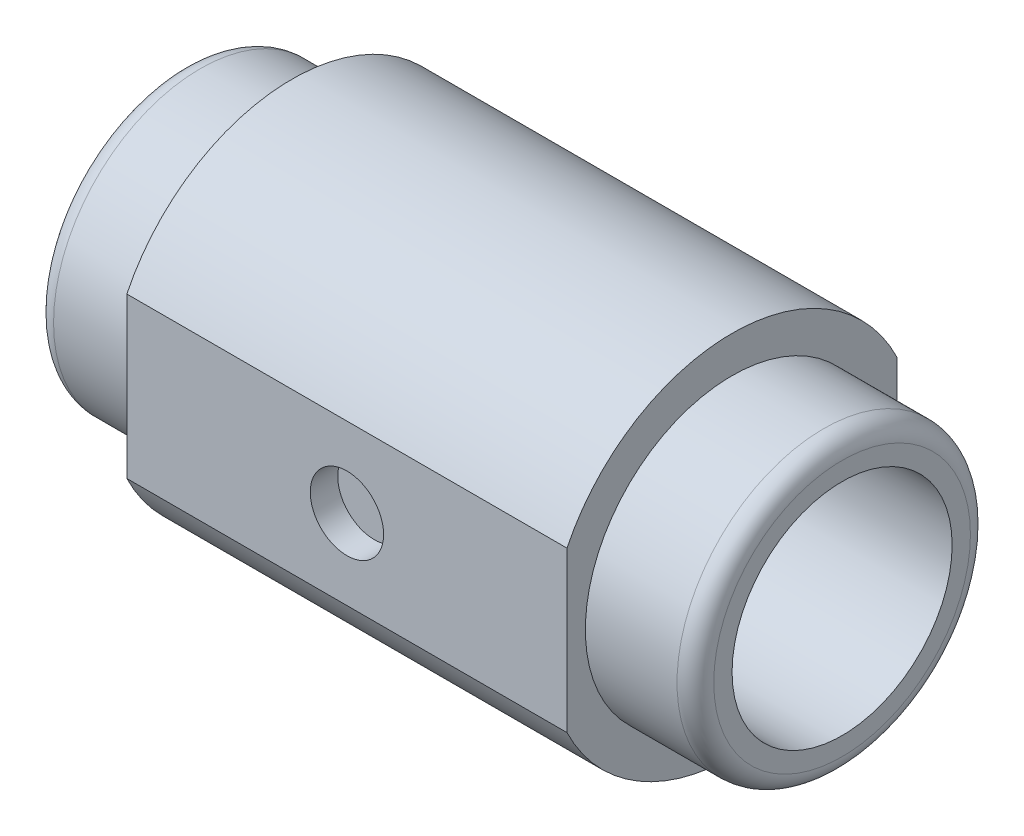
ISO-10303-21;
HEADER;
FILE_DESCRIPTION(('STEP AP214'),'2;1');
FILE_NAME('part.step','',(''),(''),'','','');
FILE_SCHEMA(('AUTOMOTIVE_DESIGN { 1 0 10303 214 1 1 1 1 }'));
ENDSEC;
DATA;
#1=APPLICATION_CONTEXT('core data for automotive mechanical design processes');
#2=APPLICATION_PROTOCOL_DEFINITION('international standard','automotive_design',2000,#1);
#3=PRODUCT_CONTEXT('',#1,'mechanical');
#4=PRODUCT('Part','Part','',(#3));
#5=PRODUCT_RELATED_PRODUCT_CATEGORY('part','',(#4));
#6=PRODUCT_DEFINITION_FORMATION('','',#4);
#7=PRODUCT_DEFINITION_CONTEXT('part definition',#1,'design');
#8=PRODUCT_DEFINITION('design','',#6,#7);
#9=PRODUCT_DEFINITION_SHAPE('','',#8);
#10=(LENGTH_UNIT() NAMED_UNIT(*) SI_UNIT(.MILLI.,.METRE.));
#11=(NAMED_UNIT(*) PLANE_ANGLE_UNIT() SI_UNIT($,.RADIAN.));
#12=(NAMED_UNIT(*) SI_UNIT($,.STERADIAN.) SOLID_ANGLE_UNIT());
#13=UNCERTAINTY_MEASURE_WITH_UNIT(LENGTH_MEASURE(1.E-05),#10,'distance_accuracy_value','');
#14=(GEOMETRIC_REPRESENTATION_CONTEXT(3) GLOBAL_UNCERTAINTY_ASSIGNED_CONTEXT((#13)) GLOBAL_UNIT_ASSIGNED_CONTEXT((#10,
#11,#12)) REPRESENTATION_CONTEXT('',''));
#15=CARTESIAN_POINT('',(0.,0.,0.));
#16=DIRECTION('',(0.,0.,1.));
#17=DIRECTION('',(1.,0.,0.));
#18=AXIS2_PLACEMENT_3D('',#15,#16,#17);
#19=CARTESIAN_POINT('',(9.6774,0.,0.));
#20=DIRECTION('',(1.,0.,0.));
#21=DIRECTION('',(0.,0.,-1.));
#22=AXIS2_PLACEMENT_3D('',#19,#20,#21);
#23=PLANE('',#22);
#24=CARTESIAN_POINT('',(9.6774,0.,0.));
#25=DIRECTION('',(1.,0.,0.));
#26=DIRECTION('',(0.,0.,-1.));
#27=AXIS2_PLACEMENT_3D('',#24,#25,#26);
#28=CIRCLE('',#27,8.0645);
#29=CARTESIAN_POINT('',(9.6774,-3.51261062282742,7.25932));
#30=VERTEX_POINT('',#29);
#31=CARTESIAN_POINT('',(9.6774,-3.51261062282742,-7.25932));
#32=VERTEX_POINT('',#31);
#33=EDGE_CURVE('E76',#30,#32,#28,.T.);
#34=ORIENTED_EDGE('',*,*,#33,.T.);
#35=DIRECTION('',(0.,1.,0.));
#36=VECTOR('',#35,1.);
#37=CARTESIAN_POINT('',(9.6774,3.51261062282742,-7.25932));
#38=LINE('',#37,#36);
#39=CARTESIAN_POINT('',(9.6774,3.51261062282742,-7.25932));
#40=VERTEX_POINT('',#39);
#41=EDGE_CURVE('E85',#32,#40,#38,.T.);
#42=ORIENTED_EDGE('',*,*,#41,.T.);
#43=CARTESIAN_POINT('',(9.6774,0.,0.));
#44=DIRECTION('',(1.,0.,0.));
#45=DIRECTION('',(0.,0.,-1.));
#46=AXIS2_PLACEMENT_3D('',#43,#44,#45);
#47=CIRCLE('',#46,8.0645);
#48=CARTESIAN_POINT('',(9.6774,3.51261062282742,7.25932));
#49=VERTEX_POINT('',#48);
#50=EDGE_CURVE('E90',#40,#49,#47,.T.);
#51=ORIENTED_EDGE('',*,*,#50,.T.);
#52=DIRECTION('',(0.,-1.,0.));
#53=VECTOR('',#52,1.);
#54=CARTESIAN_POINT('',(9.6774,3.51261062282742,7.25932));
#55=LINE('',#54,#53);
#56=EDGE_CURVE('E94',#49,#30,#55,.T.);
#57=ORIENTED_EDGE('',*,*,#56,.T.);
#58=EDGE_LOOP('',(#34,#42,#51,#57));
#59=FACE_BOUND('',#58,.T.);
#60=CARTESIAN_POINT('',(9.6774,0.,0.));
#61=DIRECTION('',(1.,0.,0.));
#62=DIRECTION('',(0.,0.,-1.));
#63=AXIS2_PLACEMENT_3D('',#60,#61,#62);
#64=CIRCLE('',#63,6.4516);
#65=CARTESIAN_POINT('',(9.6774,0.,-6.4516));
#66=VERTEX_POINT('',#65);
#67=EDGE_CURVE('E95',#66,#66,#64,.T.);
#68=ORIENTED_EDGE('',*,*,#67,.F.);
#69=EDGE_LOOP('',(#68));
#70=FACE_BOUND('',#69,.T.);
#71=ADVANCED_FACE('F32',(#59,#70),#23,.T.);
#72=CARTESIAN_POINT('',(-9.6774,0.,0.));
#73=DIRECTION('',(1.,0.,0.));
#74=DIRECTION('',(0.,0.,-1.));
#75=AXIS2_PLACEMENT_3D('',#72,#73,#74);
#76=CYLINDRICAL_SURFACE('',#75,8.0645);
#77=DIRECTION('',(1.,0.,0.));
#78=VECTOR('',#77,1.);
#79=CARTESIAN_POINT('',(-9.6774,-3.51261062282742,-7.25932));
#80=LINE('',#79,#78);
#81=CARTESIAN_POINT('',(-9.6774,-3.51261062282742,-7.25932));
#82=VERTEX_POINT('',#81);
#83=EDGE_CURVE('E72',#82,#32,#80,.T.);
#84=ORIENTED_EDGE('',*,*,#83,.T.);
#85=ORIENTED_EDGE('',*,*,#33,.F.);
#86=DIRECTION('',(1.,0.,0.));
#87=VECTOR('',#86,1.);
#88=CARTESIAN_POINT('',(-9.6774,-3.51261062282742,7.25932));
#89=LINE('',#88,#87);
#90=CARTESIAN_POINT('',(-9.6774,-3.51261062282742,7.25932));
#91=VERTEX_POINT('',#90);
#92=EDGE_CURVE('E47',#91,#30,#89,.T.);
#93=ORIENTED_EDGE('',*,*,#92,.F.);
#94=CARTESIAN_POINT('',(-9.6774,0.,0.));
#95=DIRECTION('',(1.,0.,0.));
#96=DIRECTION('',(0.,0.,-1.));
#97=AXIS2_PLACEMENT_3D('',#94,#95,#96);
#98=CIRCLE('',#97,8.0645);
#99=EDGE_CURVE('E77',#91,#82,#98,.T.);
#100=ORIENTED_EDGE('',*,*,#99,.T.);
#101=EDGE_LOOP('',(#84,#85,#93,#100));
#102=FACE_BOUND('',#101,.T.);
#103=ADVANCED_FACE('F74',(#102),#76,.T.);
#104=CARTESIAN_POINT('',(-9.6774,3.51261062282742,7.25932));
#105=DIRECTION('',(0.,0.,1.));
#106=DIRECTION('',(1.,0.,0.));
#107=AXIS2_PLACEMENT_3D('',#104,#105,#106);
#108=PLANE('',#107);
#109=CARTESIAN_POINT('',(0.,0.,7.25932));
#110=DIRECTION('',(0.,0.,1.));
#111=DIRECTION('',(1.,0.,0.));
#112=AXIS2_PLACEMENT_3D('',#109,#110,#111);
#113=CIRCLE('',#112,1.6129);
#114=CARTESIAN_POINT('',(1.6129,0.,7.25932));
#115=VERTEX_POINT('',#114);
#116=EDGE_CURVE('E242',#115,#115,#113,.T.);
#117=ORIENTED_EDGE('',*,*,#116,.F.);
#118=EDGE_LOOP('',(#117));
#119=FACE_BOUND('',#118,.T.);
#120=ORIENTED_EDGE('',*,*,#92,.T.);
#121=ORIENTED_EDGE('',*,*,#56,.F.);
#122=DIRECTION('',(1.,0.,0.));
#123=VECTOR('',#122,1.);
#124=CARTESIAN_POINT('',(-9.6774,3.51261062282742,7.25932));
#125=LINE('',#124,#123);
#126=CARTESIAN_POINT('',(-9.6774,3.51261062282742,7.25932));
#127=VERTEX_POINT('',#126);
#128=EDGE_CURVE('E55',#127,#49,#125,.T.);
#129=ORIENTED_EDGE('',*,*,#128,.F.);
#130=DIRECTION('',(0.,-1.,0.));
#131=VECTOR('',#130,1.);
#132=CARTESIAN_POINT('',(-9.6774,3.51261062282742,7.25932));
#133=LINE('',#132,#131);
#134=EDGE_CURVE('E82',#127,#91,#133,.T.);
#135=ORIENTED_EDGE('',*,*,#134,.T.);
#136=EDGE_LOOP('',(#120,#121,#129,#135));
#137=FACE_BOUND('',#136,.T.);
#138=ADVANCED_FACE('F143',(#119,#137),#108,.T.);
#139=CARTESIAN_POINT('',(-9.6774,0.,0.));
#140=DIRECTION('',(1.,0.,0.));
#141=DIRECTION('',(0.,0.,-1.));
#142=AXIS2_PLACEMENT_3D('',#139,#140,#141);
#143=CYLINDRICAL_SURFACE('',#142,8.0645);
#144=ORIENTED_EDGE('',*,*,#128,.T.);
#145=ORIENTED_EDGE('',*,*,#50,.F.);
#146=DIRECTION('',(1.,0.,0.));
#147=VECTOR('',#146,1.);
#148=CARTESIAN_POINT('',(-9.6774,3.51261062282742,-7.25932));
#149=LINE('',#148,#147);
#150=CARTESIAN_POINT('',(-9.6774,3.51261062282742,-7.25932));
#151=VERTEX_POINT('',#150);
#152=EDGE_CURVE('E81',#151,#40,#149,.T.);
#153=ORIENTED_EDGE('',*,*,#152,.F.);
#154=CARTESIAN_POINT('',(-9.6774,0.,0.));
#155=DIRECTION('',(1.,0.,0.));
#156=DIRECTION('',(0.,0.,-1.));
#157=AXIS2_PLACEMENT_3D('',#154,#155,#156);
#158=CIRCLE('',#157,8.0645);
#159=EDGE_CURVE('E107',#151,#127,#158,.T.);
#160=ORIENTED_EDGE('',*,*,#159,.T.);
#161=EDGE_LOOP('',(#144,#145,#153,#160));
#162=FACE_BOUND('',#161,.T.);
#163=ADVANCED_FACE('F155',(#162),#143,.T.);
#164=CARTESIAN_POINT('',(-9.6774,3.51261062282742,-7.25932));
#165=DIRECTION('',(0.,0.,-1.));
#166=DIRECTION('',(-1.,0.,0.));
#167=AXIS2_PLACEMENT_3D('',#164,#165,#166);
#168=PLANE('',#167);
#169=ORIENTED_EDGE('',*,*,#152,.T.);
#170=ORIENTED_EDGE('',*,*,#41,.F.);
#171=ORIENTED_EDGE('',*,*,#83,.F.);
#172=DIRECTION('',(0.,1.,0.));
#173=VECTOR('',#172,1.);
#174=CARTESIAN_POINT('',(-9.6774,3.51261062282742,-7.25932));
#175=LINE('',#174,#173);
#176=EDGE_CURVE('E105',#82,#151,#175,.T.);
#177=ORIENTED_EDGE('',*,*,#176,.T.);
#178=EDGE_LOOP('',(#169,#170,#171,#177));
#179=FACE_BOUND('',#178,.T.);
#180=ADVANCED_FACE('F86',(#179),#168,.T.);
#181=CARTESIAN_POINT('',(-9.6774,0.,0.));
#182=DIRECTION('',(1.,0.,0.));
#183=DIRECTION('',(0.,0.,-1.));
#184=AXIS2_PLACEMENT_3D('',#181,#182,#183);
#185=PLANE('',#184);
#186=CARTESIAN_POINT('',(-9.6774,0.,0.));
#187=DIRECTION('',(1.,0.,0.));
#188=DIRECTION('',(0.,0.,-1.));
#189=AXIS2_PLACEMENT_3D('',#186,#187,#188);
#190=CIRCLE('',#189,6.4516);
#191=CARTESIAN_POINT('',(-9.6774,0.,-6.4516));
#192=VERTEX_POINT('',#191);
#193=EDGE_CURVE('E98',#192,#192,#190,.T.);
#194=ORIENTED_EDGE('',*,*,#193,.T.);
#195=EDGE_LOOP('',(#194));
#196=FACE_BOUND('',#195,.T.);
#197=ORIENTED_EDGE('',*,*,#99,.F.);
#198=ORIENTED_EDGE('',*,*,#134,.F.);
#199=ORIENTED_EDGE('',*,*,#159,.F.);
#200=ORIENTED_EDGE('',*,*,#176,.F.);
#201=EDGE_LOOP('',(#197,#198,#199,#200));
#202=FACE_BOUND('',#201,.T.);
#203=ADVANCED_FACE('F149',(#196,#202),#185,.F.);
#204=CARTESIAN_POINT('',(14.5161,0.,0.));
#205=DIRECTION('',(-1.,0.,0.));
#206=DIRECTION('',(0.,0.,1.));
#207=AXIS2_PLACEMENT_3D('',#204,#205,#206);
#208=CYLINDRICAL_SURFACE('',#207,6.4516);
#209=CARTESIAN_POINT('',(13.70838,0.,0.));
#210=DIRECTION('',(1.,0.,0.));
#211=DIRECTION('',(0.,0.,-1.));
#212=AXIS2_PLACEMENT_3D('',#209,#210,#211);
#213=CIRCLE('',#212,6.4516);
#214=CARTESIAN_POINT('',(13.70838,0.,-6.4516));
#215=VERTEX_POINT('',#214);
#216=EDGE_CURVE('E11',#215,#215,#213,.F.);
#217=ORIENTED_EDGE('',*,*,#216,.T.);
#218=EDGE_LOOP('',(#217));
#219=FACE_BOUND('',#218,.T.);
#220=ORIENTED_EDGE('',*,*,#67,.T.);
#221=EDGE_LOOP('',(#220));
#222=FACE_BOUND('',#221,.T.);
#223=ADVANCED_FACE('F147',(#219,#222),#208,.T.);
#224=CARTESIAN_POINT('',(14.5161,0.,0.));
#225=DIRECTION('',(1.,0.,0.));
#226=DIRECTION('',(0.,0.,-1.));
#227=AXIS2_PLACEMENT_3D('',#224,#225,#226);
#228=PLANE('',#227);
#229=CARTESIAN_POINT('',(14.5161,0.,0.));
#230=DIRECTION('',(1.,0.,0.));
#231=DIRECTION('',(0.,0.,-1.));
#232=AXIS2_PLACEMENT_3D('',#229,#230,#231);
#233=CIRCLE('',#232,5.64388);
#234=CARTESIAN_POINT('',(14.5161,0.,-5.64388));
#235=VERTEX_POINT('',#234);
#236=EDGE_CURVE('E40',#235,#235,#233,.T.);
#237=ORIENTED_EDGE('',*,*,#236,.T.);
#238=EDGE_LOOP('',(#237));
#239=FACE_BOUND('',#238,.T.);
#240=CARTESIAN_POINT('',(14.5161,0.,0.));
#241=DIRECTION('',(1.,0.,0.));
#242=DIRECTION('',(0.,0.,-1.));
#243=AXIS2_PLACEMENT_3D('',#240,#241,#242);
#244=CIRCLE('',#243,4.8387);
#245=CARTESIAN_POINT('',(14.5161,0.,-4.8387));
#246=VERTEX_POINT('',#245);
#247=EDGE_CURVE('E241',#246,#246,#244,.T.);
#248=ORIENTED_EDGE('',*,*,#247,.F.);
#249=EDGE_LOOP('',(#248));
#250=FACE_BOUND('',#249,.T.);
#251=ADVANCED_FACE('F121',(#239,#250),#228,.T.);
#252=CARTESIAN_POINT('',(-14.5161,0.,0.));
#253=DIRECTION('',(1.,0.,0.));
#254=DIRECTION('',(0.,0.,-1.));
#255=AXIS2_PLACEMENT_3D('',#252,#253,#254);
#256=CYLINDRICAL_SURFACE('',#255,6.4516);
#257=CARTESIAN_POINT('',(-13.70838,0.,0.));
#258=DIRECTION('',(-1.,0.,0.));
#259=DIRECTION('',(0.,0.,1.));
#260=AXIS2_PLACEMENT_3D('',#257,#258,#259);
#261=CIRCLE('',#260,6.4516);
#262=CARTESIAN_POINT('',(-13.70838,0.,6.4516));
#263=VERTEX_POINT('',#262);
#264=EDGE_CURVE('E111',#263,#263,#261,.F.);
#265=ORIENTED_EDGE('',*,*,#264,.T.);
#266=EDGE_LOOP('',(#265));
#267=FACE_BOUND('',#266,.T.);
#268=ORIENTED_EDGE('',*,*,#193,.F.);
#269=EDGE_LOOP('',(#268));
#270=FACE_BOUND('',#269,.T.);
#271=ADVANCED_FACE('F182',(#267,#270),#256,.T.);
#272=CARTESIAN_POINT('',(-14.5161,0.,0.));
#273=DIRECTION('',(-1.,0.,0.));
#274=DIRECTION('',(0.,0.,-1.));
#275=AXIS2_PLACEMENT_3D('',#272,#273,#274);
#276=PLANE('',#275);
#277=CARTESIAN_POINT('',(-14.5161,0.,0.));
#278=DIRECTION('',(-1.,0.,0.));
#279=DIRECTION('',(0.,0.,1.));
#280=AXIS2_PLACEMENT_3D('',#277,#278,#279);
#281=CIRCLE('',#280,5.64388);
#282=CARTESIAN_POINT('',(-14.5161,0.,5.64388));
#283=VERTEX_POINT('',#282);
#284=EDGE_CURVE('E116',#283,#283,#281,.T.);
#285=ORIENTED_EDGE('',*,*,#284,.T.);
#286=EDGE_LOOP('',(#285));
#287=FACE_BOUND('',#286,.T.);
#288=CARTESIAN_POINT('',(-14.5161,0.,0.));
#289=DIRECTION('',(1.,0.,0.));
#290=DIRECTION('',(0.,0.,-1.));
#291=AXIS2_PLACEMENT_3D('',#288,#289,#290);
#292=CIRCLE('',#291,4.8387);
#293=CARTESIAN_POINT('',(-14.5161,0.,-4.8387));
#294=VERTEX_POINT('',#293);
#295=EDGE_CURVE('E245',#294,#294,#292,.T.);
#296=ORIENTED_EDGE('',*,*,#295,.T.);
#297=EDGE_LOOP('',(#296));
#298=FACE_BOUND('',#297,.T.);
#299=ADVANCED_FACE('F188',(#287,#298),#276,.T.);
#300=CARTESIAN_POINT('',(-14.5161,0.,0.));
#301=DIRECTION('',(1.,0.,0.));
#302=DIRECTION('',(0.,0.,-1.));
#303=AXIS2_PLACEMENT_3D('',#300,#301,#302);
#304=CYLINDRICAL_SURFACE('',#303,4.8387);
#305=ORIENTED_EDGE('',*,*,#295,.F.);
#306=EDGE_LOOP('',(#305));
#307=FACE_BOUND('',#306,.T.);
#308=ORIENTED_EDGE('',*,*,#247,.T.);
#309=EDGE_LOOP('',(#308));
#310=FACE_BOUND('',#309,.T.);
#311=ADVANCED_FACE('F135',(#307,#310),#304,.F.);
#312=CARTESIAN_POINT('',(-13.70838,0.,0.));
#313=DIRECTION('',(-1.,0.,0.));
#314=DIRECTION('',(0.,0.,1.));
#315=AXIS2_PLACEMENT_3D('',#312,#313,#314);
#316=TOROIDAL_SURFACE('',#315,5.64388,0.80772);
#317=ORIENTED_EDGE('',*,*,#284,.F.);
#318=EDGE_LOOP('',(#317));
#319=FACE_BOUND('',#318,.T.);
#320=ORIENTED_EDGE('',*,*,#264,.F.);
#321=EDGE_LOOP('',(#320));
#322=FACE_BOUND('',#321,.T.);
#323=ADVANCED_FACE('F126',(#319,#322),#316,.T.);
#324=CARTESIAN_POINT('',(13.70838,0.,0.));
#325=DIRECTION('',(1.,0.,0.));
#326=DIRECTION('',(0.,0.,-1.));
#327=AXIS2_PLACEMENT_3D('',#324,#325,#326);
#328=TOROIDAL_SURFACE('',#327,5.64388,0.80772);
#329=ORIENTED_EDGE('',*,*,#216,.F.);
#330=EDGE_LOOP('',(#329));
#331=FACE_BOUND('',#330,.T.);
#332=ORIENTED_EDGE('',*,*,#236,.F.);
#333=EDGE_LOOP('',(#332));
#334=FACE_BOUND('',#333,.T.);
#335=ADVANCED_FACE('F34',(#331,#334),#328,.T.);
#336=CARTESIAN_POINT('',(0.,0.,6.05028));
#337=DIRECTION('',(0.,0.,1.));
#338=DIRECTION('',(1.,0.,0.));
#339=AXIS2_PLACEMENT_3D('',#336,#337,#338);
#340=CYLINDRICAL_SURFACE('',#339,1.6129);
#341=CARTESIAN_POINT('',(0.,0.,6.05028));
#342=DIRECTION('',(0.,0.,1.));
#343=DIRECTION('',(1.,0.,0.));
#344=AXIS2_PLACEMENT_3D('',#341,#342,#343);
#345=CIRCLE('',#344,1.6129);
#346=CARTESIAN_POINT('',(1.6129,0.,6.05028));
#347=VERTEX_POINT('',#346);
#348=EDGE_CURVE('E240',#347,#347,#345,.T.);
#349=ORIENTED_EDGE('',*,*,#348,.F.);
#350=EDGE_LOOP('',(#349));
#351=FACE_BOUND('',#350,.T.);
#352=ORIENTED_EDGE('',*,*,#116,.T.);
#353=EDGE_LOOP('',(#352));
#354=FACE_BOUND('',#353,.T.);
#355=ADVANCED_FACE('F125',(#351,#354),#340,.F.);
#356=CARTESIAN_POINT('',(0.,0.,6.05028));
#357=DIRECTION('',(0.,0.,1.));
#358=DIRECTION('',(1.,0.,0.));
#359=AXIS2_PLACEMENT_3D('',#356,#357,#358);
#360=PLANE('',#359);
#361=ORIENTED_EDGE('',*,*,#348,.T.);
#362=EDGE_LOOP('',(#361));
#363=FACE_BOUND('',#362,.T.);
#364=ADVANCED_FACE('F132',(#363),#360,.T.);
#365=CLOSED_SHELL('',(#71,#103,#138,#163,#180,#203,#223,#251,#271,#299,#311,#323,#335,#355,#364));
#366=MANIFOLD_SOLID_BREP('B2',#365);
#367=ADVANCED_BREP_SHAPE_REPRESENTATION('',(#18,#366),#14);
#368=SHAPE_DEFINITION_REPRESENTATION(#9,#367);
ENDSEC;
END-ISO-10303-21;
